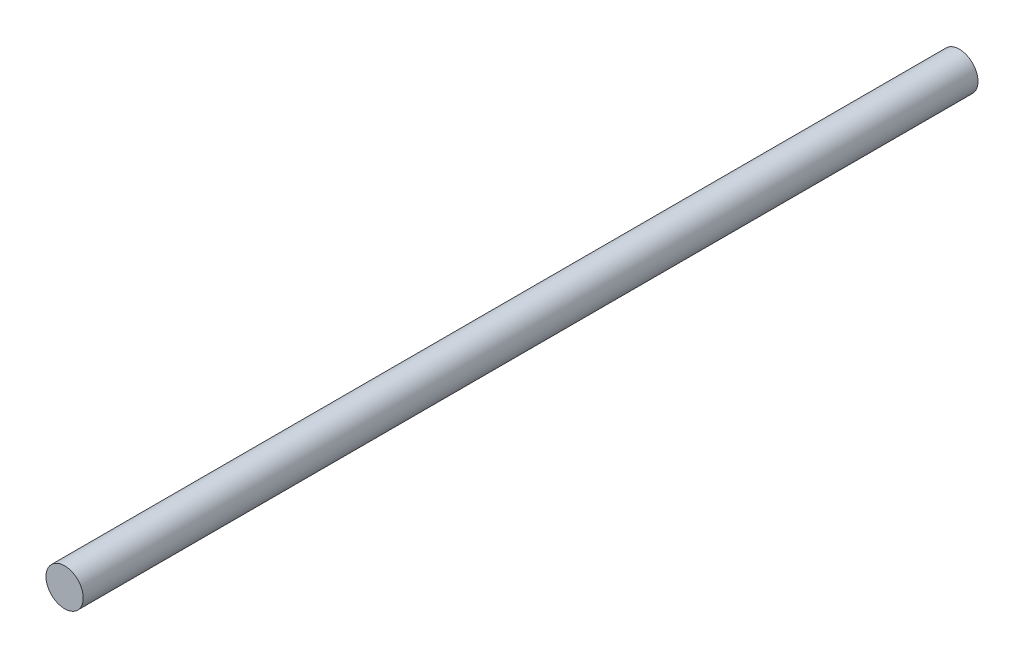
ISO-10303-21;
HEADER;
FILE_DESCRIPTION(('STEP AP214'),'2;1');
FILE_NAME('part.step','',(''),(''),'','','');
FILE_SCHEMA(('AUTOMOTIVE_DESIGN { 1 0 10303 214 1 1 1 1 }'));
ENDSEC;
DATA;
#1=APPLICATION_CONTEXT('core data for automotive mechanical design processes');
#2=APPLICATION_PROTOCOL_DEFINITION('international standard','automotive_design',2000,#1);
#3=PRODUCT_CONTEXT('',#1,'mechanical');
#4=PRODUCT('Part','Part','',(#3));
#5=PRODUCT_RELATED_PRODUCT_CATEGORY('part','',(#4));
#6=PRODUCT_DEFINITION_FORMATION('','',#4);
#7=PRODUCT_DEFINITION_CONTEXT('part definition',#1,'design');
#8=PRODUCT_DEFINITION('design','',#6,#7);
#9=PRODUCT_DEFINITION_SHAPE('','',#8);
#10=(LENGTH_UNIT() NAMED_UNIT(*) SI_UNIT(.MILLI.,.METRE.));
#11=(NAMED_UNIT(*) PLANE_ANGLE_UNIT() SI_UNIT($,.RADIAN.));
#12=(NAMED_UNIT(*) SI_UNIT($,.STERADIAN.) SOLID_ANGLE_UNIT());
#13=UNCERTAINTY_MEASURE_WITH_UNIT(LENGTH_MEASURE(1.E-05),#10,'distance_accuracy_value','');
#14=(GEOMETRIC_REPRESENTATION_CONTEXT(3) GLOBAL_UNCERTAINTY_ASSIGNED_CONTEXT((#13)) GLOBAL_UNIT_ASSIGNED_CONTEXT((#10,
#11,#12)) REPRESENTATION_CONTEXT('',''));
#15=CARTESIAN_POINT('',(0.,0.,0.));
#16=DIRECTION('',(0.,0.,1.));
#17=DIRECTION('',(1.,0.,0.));
#18=AXIS2_PLACEMENT_3D('',#15,#16,#17);
#19=CARTESIAN_POINT('',(0.,0.,120.));
#20=DIRECTION('',(0.,0.,-1.));
#21=DIRECTION('',(-1.,0.,0.));
#22=AXIS2_PLACEMENT_3D('',#19,#20,#21);
#23=CYLINDRICAL_SURFACE('',#22,2.5);
#24=CARTESIAN_POINT('',(0.,0.,120.));
#25=DIRECTION('',(0.,0.,1.));
#26=DIRECTION('',(1.,0.,0.));
#27=AXIS2_PLACEMENT_3D('',#24,#25,#26);
#28=CIRCLE('',#27,2.5);
#29=CARTESIAN_POINT('',(2.5,0.,120.));
#30=VERTEX_POINT('',#29);
#31=EDGE_CURVE('E10',#30,#30,#28,.T.);
#32=ORIENTED_EDGE('',*,*,#31,.F.);
#33=EDGE_LOOP('',(#32));
#34=FACE_BOUND('',#33,.T.);
#35=CARTESIAN_POINT('',(0.,0.,0.));
#36=DIRECTION('',(0.,0.,1.));
#37=DIRECTION('',(1.,0.,0.));
#38=AXIS2_PLACEMENT_3D('',#35,#36,#37);
#39=CIRCLE('',#38,2.5);
#40=CARTESIAN_POINT('',(2.5,0.,0.));
#41=VERTEX_POINT('',#40);
#42=EDGE_CURVE('E34',#41,#41,#39,.T.);
#43=ORIENTED_EDGE('',*,*,#42,.T.);
#44=EDGE_LOOP('',(#43));
#45=FACE_BOUND('',#44,.T.);
#46=ADVANCED_FACE('F31',(#34,#45),#23,.T.);
#47=CARTESIAN_POINT('',(0.,0.,120.));
#48=DIRECTION('',(0.,0.,1.));
#49=DIRECTION('',(1.,0.,0.));
#50=AXIS2_PLACEMENT_3D('',#47,#48,#49);
#51=PLANE('',#50);
#52=ORIENTED_EDGE('',*,*,#31,.T.);
#53=EDGE_LOOP('',(#52));
#54=FACE_BOUND('',#53,.T.);
#55=ADVANCED_FACE('F46',(#54),#51,.T.);
#56=CARTESIAN_POINT('',(0.,0.,0.));
#57=DIRECTION('',(0.,0.,1.));
#58=DIRECTION('',(1.,0.,0.));
#59=AXIS2_PLACEMENT_3D('',#56,#57,#58);
#60=PLANE('',#59);
#61=ORIENTED_EDGE('',*,*,#42,.F.);
#62=EDGE_LOOP('',(#61));
#63=FACE_BOUND('',#62,.T.);
#64=ADVANCED_FACE('F44',(#63),#60,.F.);
#65=CLOSED_SHELL('',(#46,#55,#64));
#66=MANIFOLD_SOLID_BREP('B2',#65);
#67=ADVANCED_BREP_SHAPE_REPRESENTATION('',(#18,#66),#14);
#68=SHAPE_DEFINITION_REPRESENTATION(#9,#67);
ENDSEC;
END-ISO-10303-21;
